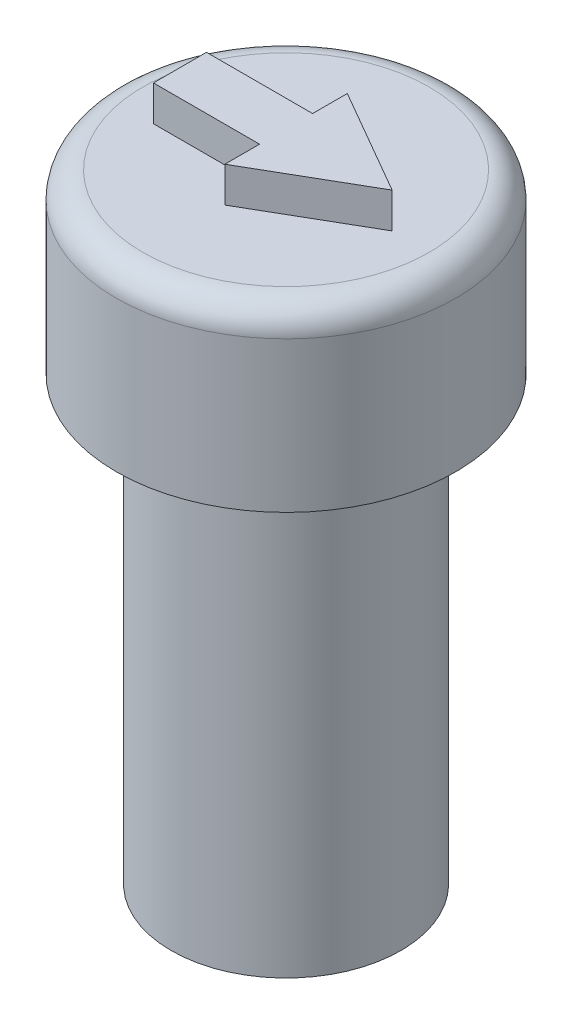
ISO-10303-21;
HEADER;
FILE_DESCRIPTION(('STEP AP214'),'2;1');
FILE_NAME('part.step','',(''),(''),'','','');
FILE_SCHEMA(('AUTOMOTIVE_DESIGN { 1 0 10303 214 1 1 1 1 }'));
ENDSEC;
DATA;
#1=APPLICATION_CONTEXT('core data for automotive mechanical design processes');
#2=APPLICATION_PROTOCOL_DEFINITION('international standard','automotive_design',2000,#1);
#3=PRODUCT_CONTEXT('',#1,'mechanical');
#4=PRODUCT('Part','Part','',(#3));
#5=PRODUCT_RELATED_PRODUCT_CATEGORY('part','',(#4));
#6=PRODUCT_DEFINITION_FORMATION('','',#4);
#7=PRODUCT_DEFINITION_CONTEXT('part definition',#1,'design');
#8=PRODUCT_DEFINITION('design','',#6,#7);
#9=PRODUCT_DEFINITION_SHAPE('','',#8);
#10=(LENGTH_UNIT() NAMED_UNIT(*) SI_UNIT(.MILLI.,.METRE.));
#11=(NAMED_UNIT(*) PLANE_ANGLE_UNIT() SI_UNIT($,.RADIAN.));
#12=(NAMED_UNIT(*) SI_UNIT($,.STERADIAN.) SOLID_ANGLE_UNIT());
#13=UNCERTAINTY_MEASURE_WITH_UNIT(LENGTH_MEASURE(1.E-05),#10,'distance_accuracy_value','');
#14=(GEOMETRIC_REPRESENTATION_CONTEXT(3) GLOBAL_UNCERTAINTY_ASSIGNED_CONTEXT((#13)) GLOBAL_UNIT_ASSIGNED_CONTEXT((#10,
#11,#12)) REPRESENTATION_CONTEXT('',''));
#15=CARTESIAN_POINT('',(0.,0.,0.));
#16=DIRECTION('',(0.,0.,1.));
#17=DIRECTION('',(1.,0.,0.));
#18=AXIS2_PLACEMENT_3D('',#15,#16,#17);
#19=CARTESIAN_POINT('',(0.,17.5,0.));
#20=DIRECTION('',(0.,1.,0.));
#21=DIRECTION('',(0.,0.,1.));
#22=AXIS2_PLACEMENT_3D('',#19,#20,#21);
#23=PLANE('',#22);
#24=CARTESIAN_POINT('',(0.,17.5,0.));
#25=DIRECTION('',(0.,1.,0.));
#26=DIRECTION('',(0.,0.,1.));
#27=AXIS2_PLACEMENT_3D('',#24,#25,#26);
#28=CIRCLE('',#27,4.05);
#29=CARTESIAN_POINT('',(0.,17.5,4.05));
#30=VERTEX_POINT('',#29);
#31=EDGE_CURVE('E129',#30,#30,#28,.T.);
#32=ORIENTED_EDGE('',*,*,#31,.T.);
#33=EDGE_LOOP('',(#32));
#34=FACE_BOUND('',#33,.T.);
#35=DIRECTION('',(-1.,0.,0.));
#36=VECTOR('',#35,1.);
#37=CARTESIAN_POINT('',(0.,17.5,-0.75));
#38=LINE('',#37,#36);
#39=CARTESIAN_POINT('',(0.,17.5,-0.75));
#40=VERTEX_POINT('',#39);
#41=CARTESIAN_POINT('',(-3.,17.5,-0.75));
#42=VERTEX_POINT('',#41);
#43=EDGE_CURVE('E219',#40,#42,#38,.T.);
#44=ORIENTED_EDGE('',*,*,#43,.F.);
#45=DIRECTION('',(0.,0.,1.));
#46=VECTOR('',#45,1.);
#47=CARTESIAN_POINT('',(0.,17.5,-1.73205080756888));
#48=LINE('',#47,#46);
#49=CARTESIAN_POINT('',(0.,17.5,-1.73205080756888));
#50=VERTEX_POINT('',#49);
#51=EDGE_CURVE('E215',#50,#40,#48,.T.);
#52=ORIENTED_EDGE('',*,*,#51,.F.);
#53=DIRECTION('',(-0.866025403784438,0.,-0.5));
#54=VECTOR('',#53,1.);
#55=CARTESIAN_POINT('',(3.,17.5,0.));
#56=LINE('',#55,#54);
#57=CARTESIAN_POINT('',(3.,17.5,0.));
#58=VERTEX_POINT('',#57);
#59=EDGE_CURVE('E167',#58,#50,#56,.T.);
#60=ORIENTED_EDGE('',*,*,#59,.F.);
#61=DIRECTION('',(0.866025403784439,0.,-0.5));
#62=VECTOR('',#61,1.);
#63=CARTESIAN_POINT('',(0.,17.5,1.73205080756888));
#64=LINE('',#63,#62);
#65=CARTESIAN_POINT('',(0.,17.5,1.73205080756888));
#66=VERTEX_POINT('',#65);
#67=EDGE_CURVE('E230',#66,#58,#64,.T.);
#68=ORIENTED_EDGE('',*,*,#67,.F.);
#69=DIRECTION('',(0.,0.,1.));
#70=VECTOR('',#69,1.);
#71=CARTESIAN_POINT('',(0.,17.5,0.75));
#72=LINE('',#71,#70);
#73=CARTESIAN_POINT('',(0.,17.5,0.75));
#74=VERTEX_POINT('',#73);
#75=EDGE_CURVE('E201',#74,#66,#72,.T.);
#76=ORIENTED_EDGE('',*,*,#75,.F.);
#77=DIRECTION('',(1.,0.,0.));
#78=VECTOR('',#77,1.);
#79=CARTESIAN_POINT('',(-3.,17.5,0.75));
#80=LINE('',#79,#78);
#81=CARTESIAN_POINT('',(-3.,17.5,0.75));
#82=VERTEX_POINT('',#81);
#83=EDGE_CURVE('E225',#82,#74,#80,.T.);
#84=ORIENTED_EDGE('',*,*,#83,.F.);
#85=DIRECTION('',(0.,0.,1.));
#86=VECTOR('',#85,1.);
#87=CARTESIAN_POINT('',(-3.,17.5,-0.75));
#88=LINE('',#87,#86);
#89=EDGE_CURVE('E222',#42,#82,#88,.T.);
#90=ORIENTED_EDGE('',*,*,#89,.F.);
#91=EDGE_LOOP('',(#44,#52,#60,#68,#76,#84,#90));
#92=FACE_BOUND('',#91,.T.);
#93=ADVANCED_FACE('F120',(#34,#92),#23,.T.);
#94=CARTESIAN_POINT('',(0.,12.5,0.));
#95=DIRECTION('',(0.,-1.,0.));
#96=DIRECTION('',(0.,0.,-1.));
#97=AXIS2_PLACEMENT_3D('',#94,#95,#96);
#98=CYLINDRICAL_SURFACE('',#97,3.25);
#99=CARTESIAN_POINT('',(0.,12.5,0.));
#100=DIRECTION('',(0.,1.,0.));
#101=DIRECTION('',(0.,0.,1.));
#102=AXIS2_PLACEMENT_3D('',#99,#100,#101);
#103=CIRCLE('',#102,3.25);
#104=CARTESIAN_POINT('',(0.,12.5,3.25));
#105=VERTEX_POINT('',#104);
#106=EDGE_CURVE('E266',#105,#105,#103,.T.);
#107=ORIENTED_EDGE('',*,*,#106,.F.);
#108=EDGE_LOOP('',(#107));
#109=FACE_BOUND('',#108,.T.);
#110=CARTESIAN_POINT('',(0.,0.,0.));
#111=DIRECTION('',(0.,1.,0.));
#112=DIRECTION('',(0.,0.,1.));
#113=AXIS2_PLACEMENT_3D('',#110,#111,#112);
#114=CIRCLE('',#113,3.25);
#115=CARTESIAN_POINT('',(0.,0.,3.25));
#116=VERTEX_POINT('',#115);
#117=EDGE_CURVE('E262',#116,#116,#114,.T.);
#118=ORIENTED_EDGE('',*,*,#117,.T.);
#119=EDGE_LOOP('',(#118));
#120=FACE_BOUND('',#119,.T.);
#121=ADVANCED_FACE('F295',(#109,#120),#98,.T.);
#122=CARTESIAN_POINT('',(0.,0.,0.));
#123=DIRECTION('',(0.,1.,0.));
#124=DIRECTION('',(0.,0.,1.));
#125=AXIS2_PLACEMENT_3D('',#122,#123,#124);
#126=PLANE('',#125);
#127=CARTESIAN_POINT('',(0.,0.,0.));
#128=DIRECTION('',(0.,-1.,0.));
#129=DIRECTION('',(0.,0.,-1.));
#130=AXIS2_PLACEMENT_3D('',#127,#128,#129);
#131=CIRCLE('',#130,1.75);
#132=CARTESIAN_POINT('',(0.,0.,-1.75));
#133=VERTEX_POINT('',#132);
#134=EDGE_CURVE('E257',#133,#133,#131,.T.);
#135=ORIENTED_EDGE('',*,*,#134,.F.);
#136=EDGE_LOOP('',(#135));
#137=FACE_BOUND('',#136,.T.);
#138=ORIENTED_EDGE('',*,*,#117,.F.);
#139=EDGE_LOOP('',(#138));
#140=FACE_BOUND('',#139,.T.);
#141=ADVANCED_FACE('F300',(#137,#140),#126,.F.);
#142=CARTESIAN_POINT('',(0.,2.5,0.));
#143=DIRECTION('',(0.,-1.,0.));
#144=DIRECTION('',(0.,0.,-1.));
#145=AXIS2_PLACEMENT_3D('',#142,#143,#144);
#146=CYLINDRICAL_SURFACE('',#145,1.75);
#147=CARTESIAN_POINT('',(0.,2.5,0.));
#148=DIRECTION('',(0.,-1.,0.));
#149=DIRECTION('',(0.,0.,-1.));
#150=AXIS2_PLACEMENT_3D('',#147,#148,#149);
#151=CIRCLE('',#150,1.75);
#152=CARTESIAN_POINT('',(0.,2.5,-1.75));
#153=VERTEX_POINT('',#152);
#154=EDGE_CURVE('E258',#153,#153,#151,.T.);
#155=ORIENTED_EDGE('',*,*,#154,.F.);
#156=EDGE_LOOP('',(#155));
#157=FACE_BOUND('',#156,.T.);
#158=ORIENTED_EDGE('',*,*,#134,.T.);
#159=EDGE_LOOP('',(#158));
#160=FACE_BOUND('',#159,.T.);
#161=ADVANCED_FACE('F309',(#157,#160),#146,.F.);
#162=CARTESIAN_POINT('',(0.,2.5,0.));
#163=DIRECTION('',(0.,-1.,0.));
#164=DIRECTION('',(0.,0.,-1.));
#165=AXIS2_PLACEMENT_3D('',#162,#163,#164);
#166=PLANE('',#165);
#167=ORIENTED_EDGE('',*,*,#154,.T.);
#168=EDGE_LOOP('',(#167));
#169=FACE_BOUND('',#168,.T.);
#170=ADVANCED_FACE('F305',(#169),#166,.T.);
#171=CARTESIAN_POINT('',(0.,17.5,0.));
#172=DIRECTION('',(0.,-1.,0.));
#173=DIRECTION('',(0.,0.,-1.));
#174=AXIS2_PLACEMENT_3D('',#171,#172,#173);
#175=CYLINDRICAL_SURFACE('',#174,4.8);
#176=CARTESIAN_POINT('',(0.,16.75,0.));
#177=DIRECTION('',(0.,1.,0.));
#178=DIRECTION('',(0.,0.,1.));
#179=AXIS2_PLACEMENT_3D('',#176,#177,#178);
#180=CIRCLE('',#179,4.8);
#181=CARTESIAN_POINT('',(0.,16.75,4.8));
#182=VERTEX_POINT('',#181);
#183=EDGE_CURVE('E12',#182,#182,#180,.F.);
#184=ORIENTED_EDGE('',*,*,#183,.T.);
#185=EDGE_LOOP('',(#184));
#186=FACE_BOUND('',#185,.T.);
#187=CARTESIAN_POINT('',(0.,12.5,0.));
#188=DIRECTION('',(0.,1.,0.));
#189=DIRECTION('',(0.,0.,1.));
#190=AXIS2_PLACEMENT_3D('',#187,#188,#189);
#191=CIRCLE('',#190,4.8);
#192=CARTESIAN_POINT('',(0.,12.5,4.8));
#193=VERTEX_POINT('',#192);
#194=EDGE_CURVE('E253',#193,#193,#191,.T.);
#195=ORIENTED_EDGE('',*,*,#194,.T.);
#196=EDGE_LOOP('',(#195));
#197=FACE_BOUND('',#196,.T.);
#198=ADVANCED_FACE('F291',(#186,#197),#175,.T.);
#199=CARTESIAN_POINT('',(0.,12.5,0.));
#200=DIRECTION('',(0.,1.,0.));
#201=DIRECTION('',(0.,0.,1.));
#202=AXIS2_PLACEMENT_3D('',#199,#200,#201);
#203=PLANE('',#202);
#204=ORIENTED_EDGE('',*,*,#106,.T.);
#205=EDGE_LOOP('',(#204));
#206=FACE_BOUND('',#205,.T.);
#207=ORIENTED_EDGE('',*,*,#194,.F.);
#208=EDGE_LOOP('',(#207));
#209=FACE_BOUND('',#208,.T.);
#210=ADVANCED_FACE('F280',(#206,#209),#203,.F.);
#211=CARTESIAN_POINT('',(0.,16.75,0.));
#212=DIRECTION('',(0.,1.,0.));
#213=DIRECTION('',(0.,0.,1.));
#214=AXIS2_PLACEMENT_3D('',#211,#212,#213);
#215=TOROIDAL_SURFACE('',#214,4.05,0.75);
#216=ORIENTED_EDGE('',*,*,#183,.F.);
#217=EDGE_LOOP('',(#216));
#218=FACE_BOUND('',#217,.T.);
#219=ORIENTED_EDGE('',*,*,#31,.F.);
#220=EDGE_LOOP('',(#219));
#221=FACE_BOUND('',#220,.T.);
#222=ADVANCED_FACE('F122',(#218,#221),#215,.T.);
#223=CARTESIAN_POINT('',(0.,18.5,-1.73205080756888));
#224=DIRECTION('',(1.,0.,0.));
#225=DIRECTION('',(0.,0.,-1.));
#226=AXIS2_PLACEMENT_3D('',#223,#224,#225);
#227=PLANE('',#226);
#228=ORIENTED_EDGE('',*,*,#51,.T.);
#229=DIRECTION('',(0.,-1.,0.));
#230=VECTOR('',#229,1.);
#231=CARTESIAN_POINT('',(0.,18.5,-0.75));
#232=LINE('',#231,#230);
#233=CARTESIAN_POINT('',(0.,18.5,-0.75));
#234=VERTEX_POINT('',#233);
#235=EDGE_CURVE('E250',#234,#40,#232,.T.);
#236=ORIENTED_EDGE('',*,*,#235,.F.);
#237=DIRECTION('',(0.,0.,1.));
#238=VECTOR('',#237,1.);
#239=CARTESIAN_POINT('',(0.,18.5,-1.73205080756888));
#240=LINE('',#239,#238);
#241=CARTESIAN_POINT('',(0.,18.5,-1.73205080756888));
#242=VERTEX_POINT('',#241);
#243=EDGE_CURVE('E235',#242,#234,#240,.T.);
#244=ORIENTED_EDGE('',*,*,#243,.F.);
#245=DIRECTION('',(0.,-1.,0.));
#246=VECTOR('',#245,1.);
#247=CARTESIAN_POINT('',(0.,18.5,-1.73205080756888));
#248=LINE('',#247,#246);
#249=EDGE_CURVE('E211',#242,#50,#248,.T.);
#250=ORIENTED_EDGE('',*,*,#249,.T.);
#251=EDGE_LOOP('',(#228,#236,#244,#250));
#252=FACE_BOUND('',#251,.T.);
#253=ADVANCED_FACE('F279',(#252),#227,.F.);
#254=CARTESIAN_POINT('',(0.,18.5,-0.75));
#255=DIRECTION('',(0.,0.,1.));
#256=DIRECTION('',(1.,0.,0.));
#257=AXIS2_PLACEMENT_3D('',#254,#255,#256);
#258=PLANE('',#257);
#259=ORIENTED_EDGE('',*,*,#43,.T.);
#260=DIRECTION('',(0.,-1.,0.));
#261=VECTOR('',#260,1.);
#262=CARTESIAN_POINT('',(-3.,18.5,-0.75));
#263=LINE('',#262,#261);
#264=CARTESIAN_POINT('',(-3.,18.5,-0.75));
#265=VERTEX_POINT('',#264);
#266=EDGE_CURVE('E246',#265,#42,#263,.T.);
#267=ORIENTED_EDGE('',*,*,#266,.F.);
#268=DIRECTION('',(-1.,0.,0.));
#269=VECTOR('',#268,1.);
#270=CARTESIAN_POINT('',(0.,18.5,-0.75));
#271=LINE('',#270,#269);
#272=EDGE_CURVE('E175',#234,#265,#271,.T.);
#273=ORIENTED_EDGE('',*,*,#272,.F.);
#274=ORIENTED_EDGE('',*,*,#235,.T.);
#275=EDGE_LOOP('',(#259,#267,#273,#274));
#276=FACE_BOUND('',#275,.T.);
#277=ADVANCED_FACE('F287',(#276),#258,.F.);
#278=CARTESIAN_POINT('',(-3.,18.5,-0.75));
#279=DIRECTION('',(1.,0.,0.));
#280=DIRECTION('',(0.,0.,-1.));
#281=AXIS2_PLACEMENT_3D('',#278,#279,#280);
#282=PLANE('',#281);
#283=ORIENTED_EDGE('',*,*,#89,.T.);
#284=DIRECTION('',(0.,-1.,0.));
#285=VECTOR('',#284,1.);
#286=CARTESIAN_POINT('',(-3.,18.5,0.75));
#287=LINE('',#286,#285);
#288=CARTESIAN_POINT('',(-3.,18.5,0.75));
#289=VERTEX_POINT('',#288);
#290=EDGE_CURVE('E242',#289,#82,#287,.T.);
#291=ORIENTED_EDGE('',*,*,#290,.F.);
#292=DIRECTION('',(0.,0.,1.));
#293=VECTOR('',#292,1.);
#294=CARTESIAN_POINT('',(-3.,18.5,-0.75));
#295=LINE('',#294,#293);
#296=EDGE_CURVE('E435',#265,#289,#295,.T.);
#297=ORIENTED_EDGE('',*,*,#296,.F.);
#298=ORIENTED_EDGE('',*,*,#266,.T.);
#299=EDGE_LOOP('',(#283,#291,#297,#298));
#300=FACE_BOUND('',#299,.T.);
#301=ADVANCED_FACE('F369',(#300),#282,.F.);
#302=CARTESIAN_POINT('',(-3.,18.5,0.75));
#303=DIRECTION('',(0.,0.,-1.));
#304=DIRECTION('',(-1.,0.,0.));
#305=AXIS2_PLACEMENT_3D('',#302,#303,#304);
#306=PLANE('',#305);
#307=ORIENTED_EDGE('',*,*,#83,.T.);
#308=DIRECTION('',(0.,-1.,0.));
#309=VECTOR('',#308,1.);
#310=CARTESIAN_POINT('',(0.,18.5,0.75));
#311=LINE('',#310,#309);
#312=CARTESIAN_POINT('',(0.,18.5,0.75));
#313=VERTEX_POINT('',#312);
#314=EDGE_CURVE('E205',#313,#74,#311,.T.);
#315=ORIENTED_EDGE('',*,*,#314,.F.);
#316=DIRECTION('',(1.,0.,0.));
#317=VECTOR('',#316,1.);
#318=CARTESIAN_POINT('',(-3.,18.5,0.75));
#319=LINE('',#318,#317);
#320=EDGE_CURVE('E191',#289,#313,#319,.T.);
#321=ORIENTED_EDGE('',*,*,#320,.F.);
#322=ORIENTED_EDGE('',*,*,#290,.T.);
#323=EDGE_LOOP('',(#307,#315,#321,#322));
#324=FACE_BOUND('',#323,.T.);
#325=ADVANCED_FACE('F376',(#324),#306,.F.);
#326=CARTESIAN_POINT('',(0.,18.5,0.75));
#327=DIRECTION('',(1.,0.,0.));
#328=DIRECTION('',(0.,0.,-1.));
#329=AXIS2_PLACEMENT_3D('',#326,#327,#328);
#330=PLANE('',#329);
#331=ORIENTED_EDGE('',*,*,#75,.T.);
#332=DIRECTION('',(0.,-1.,0.));
#333=VECTOR('',#332,1.);
#334=CARTESIAN_POINT('',(0.,18.5,1.73205080756888));
#335=LINE('',#334,#333);
#336=CARTESIAN_POINT('',(0.,18.5,1.73205080756888));
#337=VERTEX_POINT('',#336);
#338=EDGE_CURVE('E198',#337,#66,#335,.T.);
#339=ORIENTED_EDGE('',*,*,#338,.F.);
#340=DIRECTION('',(0.,0.,1.));
#341=VECTOR('',#340,1.);
#342=CARTESIAN_POINT('',(0.,18.5,0.75));
#343=LINE('',#342,#341);
#344=EDGE_CURVE('E185',#313,#337,#343,.T.);
#345=ORIENTED_EDGE('',*,*,#344,.F.);
#346=ORIENTED_EDGE('',*,*,#314,.T.);
#347=EDGE_LOOP('',(#331,#339,#345,#346));
#348=FACE_BOUND('',#347,.T.);
#349=ADVANCED_FACE('F199',(#348),#330,.F.);
#350=CARTESIAN_POINT('',(0.,18.5,1.73205080756888));
#351=DIRECTION('',(-0.5,0.,-0.866025403784439));
#352=DIRECTION('',(-0.866025403784439,0.,0.5));
#353=AXIS2_PLACEMENT_3D('',#350,#351,#352);
#354=PLANE('',#353);
#355=ORIENTED_EDGE('',*,*,#67,.T.);
#356=DIRECTION('',(0.,-1.,0.));
#357=VECTOR('',#356,1.);
#358=CARTESIAN_POINT('',(3.,18.5,0.));
#359=LINE('',#358,#357);
#360=CARTESIAN_POINT('',(3.,18.5,0.));
#361=VERTEX_POINT('',#360);
#362=EDGE_CURVE('E136',#361,#58,#359,.T.);
#363=ORIENTED_EDGE('',*,*,#362,.F.);
#364=DIRECTION('',(0.866025403784439,0.,-0.5));
#365=VECTOR('',#364,1.);
#366=CARTESIAN_POINT('',(0.,18.5,1.73205080756888));
#367=LINE('',#366,#365);
#368=EDGE_CURVE('E189',#337,#361,#367,.T.);
#369=ORIENTED_EDGE('',*,*,#368,.F.);
#370=ORIENTED_EDGE('',*,*,#338,.T.);
#371=EDGE_LOOP('',(#355,#363,#369,#370));
#372=FACE_BOUND('',#371,.T.);
#373=ADVANCED_FACE('F207',(#372),#354,.F.);
#374=CARTESIAN_POINT('',(3.,18.5,0.));
#375=DIRECTION('',(-0.5,0.,0.866025403784438));
#376=DIRECTION('',(0.866025403784438,0.,0.5));
#377=AXIS2_PLACEMENT_3D('',#374,#375,#376);
#378=PLANE('',#377);
#379=ORIENTED_EDGE('',*,*,#59,.T.);
#380=ORIENTED_EDGE('',*,*,#249,.F.);
#381=DIRECTION('',(-0.866025403784438,0.,-0.5));
#382=VECTOR('',#381,1.);
#383=CARTESIAN_POINT('',(3.,18.5,0.));
#384=LINE('',#383,#382);
#385=EDGE_CURVE('E144',#361,#242,#384,.T.);
#386=ORIENTED_EDGE('',*,*,#385,.F.);
#387=ORIENTED_EDGE('',*,*,#362,.T.);
#388=EDGE_LOOP('',(#379,#380,#386,#387));
#389=FACE_BOUND('',#388,.T.);
#390=ADVANCED_FACE('F400',(#389),#378,.F.);
#391=CARTESIAN_POINT('',(0.,18.5,0.));
#392=DIRECTION('',(0.,-1.,0.));
#393=DIRECTION('',(0.,0.,-1.));
#394=AXIS2_PLACEMENT_3D('',#391,#392,#393);
#395=PLANE('',#394);
#396=ORIENTED_EDGE('',*,*,#243,.T.);
#397=ORIENTED_EDGE('',*,*,#272,.T.);
#398=ORIENTED_EDGE('',*,*,#296,.T.);
#399=ORIENTED_EDGE('',*,*,#320,.T.);
#400=ORIENTED_EDGE('',*,*,#344,.T.);
#401=ORIENTED_EDGE('',*,*,#368,.T.);
#402=ORIENTED_EDGE('',*,*,#385,.T.);
#403=EDGE_LOOP('',(#396,#397,#398,#399,#400,#401,#402));
#404=FACE_BOUND('',#403,.T.);
#405=ADVANCED_FACE('F187',(#404),#395,.F.);
#406=CLOSED_SHELL('',(#93,#121,#141,#161,#170,#198,#210,#222,#253,#277,#301,#325,#349,#373,#390,#405));
#407=MANIFOLD_SOLID_BREP('B2',#406);
#408=ADVANCED_BREP_SHAPE_REPRESENTATION('',(#18,#407),#14);
#409=SHAPE_DEFINITION_REPRESENTATION(#9,#408);
ENDSEC;
END-ISO-10303-21;
